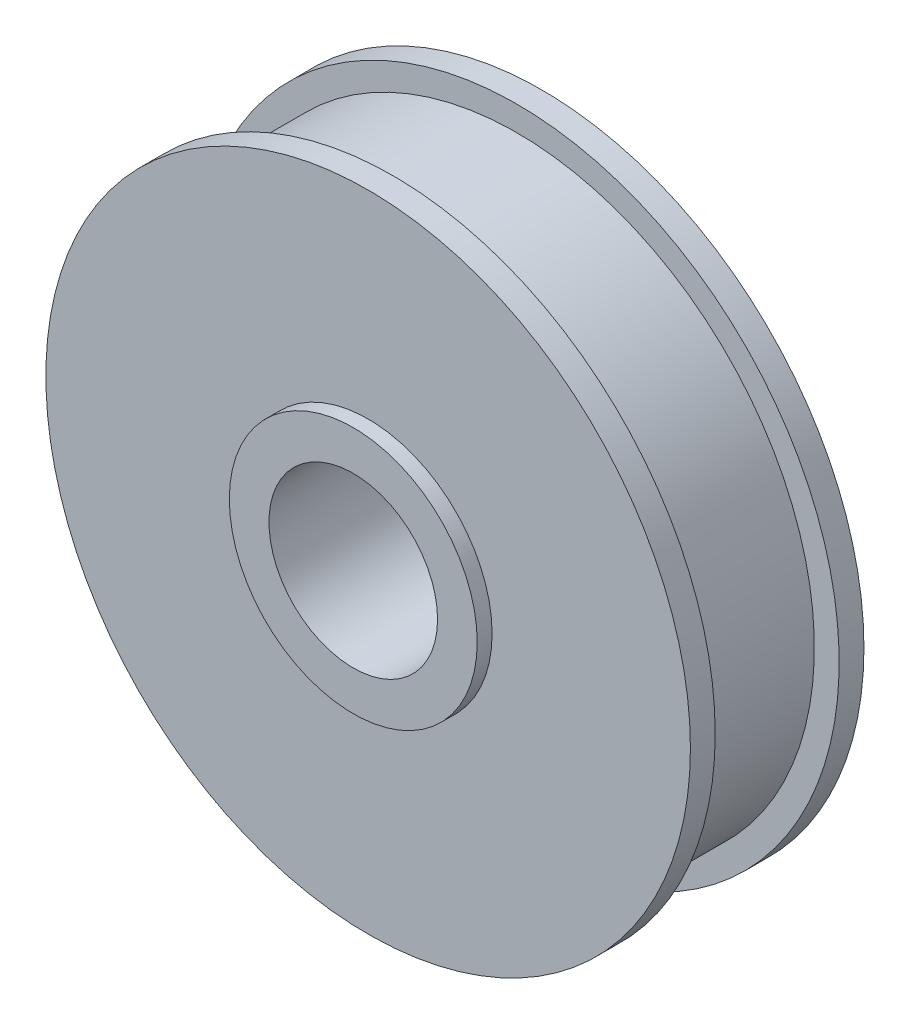
ISO-10303-21;
HEADER;
FILE_DESCRIPTION(('STEP AP214'),'2;1');
FILE_NAME('part.step','',(''),(''),'','','');
FILE_SCHEMA(('AUTOMOTIVE_DESIGN { 1 0 10303 214 1 1 1 1 }'));
ENDSEC;
DATA;
#1=APPLICATION_CONTEXT('core data for automotive mechanical design processes');
#2=APPLICATION_PROTOCOL_DEFINITION('international standard','automotive_design',2000,#1);
#3=PRODUCT_CONTEXT('',#1,'mechanical');
#4=PRODUCT('Part','Part','',(#3));
#5=PRODUCT_RELATED_PRODUCT_CATEGORY('part','',(#4));
#6=PRODUCT_DEFINITION_FORMATION('','',#4);
#7=PRODUCT_DEFINITION_CONTEXT('part definition',#1,'design');
#8=PRODUCT_DEFINITION('design','',#6,#7);
#9=PRODUCT_DEFINITION_SHAPE('','',#8);
#10=(LENGTH_UNIT() NAMED_UNIT(*) SI_UNIT(.MILLI.,.METRE.));
#11=(NAMED_UNIT(*) PLANE_ANGLE_UNIT() SI_UNIT($,.RADIAN.));
#12=(NAMED_UNIT(*) SI_UNIT($,.STERADIAN.) SOLID_ANGLE_UNIT());
#13=UNCERTAINTY_MEASURE_WITH_UNIT(LENGTH_MEASURE(1.E-05),#10,'distance_accuracy_value','');
#14=(GEOMETRIC_REPRESENTATION_CONTEXT(3) GLOBAL_UNCERTAINTY_ASSIGNED_CONTEXT((#13)) GLOBAL_UNIT_ASSIGNED_CONTEXT((#10,
#11,#12)) REPRESENTATION_CONTEXT('',''));
#15=CARTESIAN_POINT('',(0.,0.,0.));
#16=DIRECTION('',(0.,0.,1.));
#17=DIRECTION('',(1.,0.,0.));
#18=AXIS2_PLACEMENT_3D('',#15,#16,#17);
#19=CARTESIAN_POINT('',(0.,0.,3.5));
#20=DIRECTION('',(0.,0.,1.));
#21=DIRECTION('',(1.,0.,0.));
#22=AXIS2_PLACEMENT_3D('',#19,#20,#21);
#23=PLANE('',#22);
#24=CARTESIAN_POINT('',(0.,0.,3.5));
#25=DIRECTION('',(0.,0.,1.));
#26=DIRECTION('',(1.,0.,0.));
#27=AXIS2_PLACEMENT_3D('',#24,#25,#26);
#28=CIRCLE('',#27,6.5);
#29=CARTESIAN_POINT('',(6.5,0.,3.5));
#30=VERTEX_POINT('',#29);
#31=EDGE_CURVE('E11',#30,#30,#28,.T.);
#32=ORIENTED_EDGE('',*,*,#31,.T.);
#33=EDGE_LOOP('',(#32));
#34=FACE_BOUND('',#33,.T.);
#35=CARTESIAN_POINT('',(0.,0.,3.5));
#36=DIRECTION('',(0.,0.,1.));
#37=DIRECTION('',(1.,0.,0.));
#38=AXIS2_PLACEMENT_3D('',#35,#36,#37);
#39=CIRCLE('',#38,2.5);
#40=CARTESIAN_POINT('',(2.5,0.,3.5));
#41=VERTEX_POINT('',#40);
#42=EDGE_CURVE('E47',#41,#41,#39,.T.);
#43=ORIENTED_EDGE('',*,*,#42,.F.);
#44=EDGE_LOOP('',(#43));
#45=FACE_BOUND('',#44,.T.);
#46=ADVANCED_FACE('F34',(#34,#45),#23,.T.);
#47=CARTESIAN_POINT('',(0.,0.,3.5));
#48=DIRECTION('',(0.,0.,-1.));
#49=DIRECTION('',(-1.,0.,0.));
#50=AXIS2_PLACEMENT_3D('',#47,#48,#49);
#51=CYLINDRICAL_SURFACE('',#50,6.5);
#52=CARTESIAN_POINT('',(0.,0.,3.));
#53=DIRECTION('',(0.,0.,1.));
#54=DIRECTION('',(1.,0.,0.));
#55=AXIS2_PLACEMENT_3D('',#52,#53,#54);
#56=CIRCLE('',#55,6.5);
#57=CARTESIAN_POINT('',(6.5,0.,3.));
#58=VERTEX_POINT('',#57);
#59=EDGE_CURVE('E56',#58,#58,#56,.F.);
#60=ORIENTED_EDGE('',*,*,#59,.F.);
#61=EDGE_LOOP('',(#60));
#62=FACE_BOUND('',#61,.T.);
#63=ORIENTED_EDGE('',*,*,#31,.F.);
#64=EDGE_LOOP('',(#63));
#65=FACE_BOUND('',#64,.T.);
#66=ADVANCED_FACE('F36',(#62,#65),#51,.T.);
#67=CARTESIAN_POINT('',(0.,0.,3.8));
#68=DIRECTION('',(0.,0.,-1.));
#69=DIRECTION('',(-1.,0.,0.));
#70=AXIS2_PLACEMENT_3D('',#67,#68,#69);
#71=CYLINDRICAL_SURFACE('',#70,2.5);
#72=CARTESIAN_POINT('',(0.,0.,3.8));
#73=DIRECTION('',(0.,0.,1.));
#74=DIRECTION('',(1.,0.,0.));
#75=AXIS2_PLACEMENT_3D('',#72,#73,#74);
#76=CIRCLE('',#75,2.5);
#77=CARTESIAN_POINT('',(2.5,0.,3.8));
#78=VERTEX_POINT('',#77);
#79=EDGE_CURVE('E45',#78,#78,#76,.T.);
#80=ORIENTED_EDGE('',*,*,#79,.F.);
#81=EDGE_LOOP('',(#80));
#82=FACE_BOUND('',#81,.T.);
#83=ORIENTED_EDGE('',*,*,#42,.T.);
#84=EDGE_LOOP('',(#83));
#85=FACE_BOUND('',#84,.T.);
#86=ADVANCED_FACE('F85',(#82,#85),#71,.T.);
#87=CARTESIAN_POINT('',(0.,0.,3.8));
#88=DIRECTION('',(0.,0.,1.));
#89=DIRECTION('',(1.,0.,0.));
#90=AXIS2_PLACEMENT_3D('',#87,#88,#89);
#91=PLANE('',#90);
#92=CARTESIAN_POINT('',(0.,0.,3.8));
#93=DIRECTION('',(0.,0.,1.));
#94=DIRECTION('',(1.,0.,0.));
#95=AXIS2_PLACEMENT_3D('',#92,#93,#94);
#96=CIRCLE('',#95,1.7);
#97=CARTESIAN_POINT('',(1.7,0.,3.8));
#98=VERTEX_POINT('',#97);
#99=EDGE_CURVE('E65',#98,#98,#96,.T.);
#100=ORIENTED_EDGE('',*,*,#99,.F.);
#101=EDGE_LOOP('',(#100));
#102=FACE_BOUND('',#101,.T.);
#103=ORIENTED_EDGE('',*,*,#79,.T.);
#104=EDGE_LOOP('',(#103));
#105=FACE_BOUND('',#104,.T.);
#106=ADVANCED_FACE('F81',(#102,#105),#91,.T.);
#107=CARTESIAN_POINT('',(0.,0.,21.8847763108502));
#108=DIRECTION('',(0.,0.,-1.));
#109=DIRECTION('',(-1.,0.,0.));
#110=AXIS2_PLACEMENT_3D('',#107,#108,#109);
#111=CYLINDRICAL_SURFACE('',#110,6.);
#112=CARTESIAN_POINT('',(0.,0.,0.5));
#113=DIRECTION('',(0.,0.,-1.));
#114=DIRECTION('',(-1.,0.,0.));
#115=AXIS2_PLACEMENT_3D('',#112,#113,#114);
#116=CIRCLE('',#115,6.);
#117=CARTESIAN_POINT('',(-6.,0.,0.5));
#118=VERTEX_POINT('',#117);
#119=EDGE_CURVE('E59',#118,#118,#116,.T.);
#120=ORIENTED_EDGE('',*,*,#119,.F.);
#121=EDGE_LOOP('',(#120));
#122=FACE_BOUND('',#121,.T.);
#123=CARTESIAN_POINT('',(0.,0.,3.));
#124=DIRECTION('',(0.,0.,1.));
#125=DIRECTION('',(1.,0.,0.));
#126=AXIS2_PLACEMENT_3D('',#123,#124,#125);
#127=CIRCLE('',#126,6.);
#128=CARTESIAN_POINT('',(6.,0.,3.));
#129=VERTEX_POINT('',#128);
#130=EDGE_CURVE('E50',#129,#129,#127,.F.);
#131=ORIENTED_EDGE('',*,*,#130,.T.);
#132=EDGE_LOOP('',(#131));
#133=FACE_BOUND('',#132,.T.);
#134=ADVANCED_FACE('F84',(#122,#133),#111,.T.);
#135=CARTESIAN_POINT('',(0.,0.,0.5));
#136=DIRECTION('',(0.,0.,-1.));
#137=DIRECTION('',(-1.,0.,0.));
#138=AXIS2_PLACEMENT_3D('',#135,#136,#137);
#139=PLANE('',#138);
#140=ORIENTED_EDGE('',*,*,#119,.T.);
#141=EDGE_LOOP('',(#140));
#142=FACE_BOUND('',#141,.T.);
#143=CARTESIAN_POINT('',(0.,0.,0.5));
#144=DIRECTION('',(0.,0.,-1.));
#145=DIRECTION('',(-1.,0.,0.));
#146=AXIS2_PLACEMENT_3D('',#143,#144,#145);
#147=CIRCLE('',#146,6.5);
#148=CARTESIAN_POINT('',(-6.5,0.,0.5));
#149=VERTEX_POINT('',#148);
#150=EDGE_CURVE('E55',#149,#149,#147,.T.);
#151=ORIENTED_EDGE('',*,*,#150,.F.);
#152=EDGE_LOOP('',(#151));
#153=FACE_BOUND('',#152,.T.);
#154=ADVANCED_FACE('F107',(#142,#153),#139,.F.);
#155=CARTESIAN_POINT('',(0.,0.,3.));
#156=DIRECTION('',(0.,0.,1.));
#157=DIRECTION('',(1.,0.,0.));
#158=AXIS2_PLACEMENT_3D('',#155,#156,#157);
#159=PLANE('',#158);
#160=ORIENTED_EDGE('',*,*,#59,.T.);
#161=EDGE_LOOP('',(#160));
#162=FACE_BOUND('',#161,.T.);
#163=ORIENTED_EDGE('',*,*,#130,.F.);
#164=EDGE_LOOP('',(#163));
#165=FACE_BOUND('',#164,.T.);
#166=ADVANCED_FACE('F101',(#162,#165),#159,.F.);
#167=CARTESIAN_POINT('',(0.,0.,0.));
#168=DIRECTION('',(0.,0.,1.));
#169=DIRECTION('',(1.,0.,0.));
#170=AXIS2_PLACEMENT_3D('',#167,#168,#169);
#171=PLANE('',#170);
#172=CARTESIAN_POINT('',(0.,0.,0.));
#173=DIRECTION('',(0.,0.,1.));
#174=DIRECTION('',(1.,0.,0.));
#175=AXIS2_PLACEMENT_3D('',#172,#173,#174);
#176=CIRCLE('',#175,1.7);
#177=CARTESIAN_POINT('',(1.7,0.,0.));
#178=VERTEX_POINT('',#177);
#179=EDGE_CURVE('E60',#178,#178,#176,.T.);
#180=ORIENTED_EDGE('',*,*,#179,.T.);
#181=EDGE_LOOP('',(#180));
#182=FACE_BOUND('',#181,.T.);
#183=CARTESIAN_POINT('',(0.,0.,0.));
#184=DIRECTION('',(0.,0.,1.));
#185=DIRECTION('',(1.,0.,0.));
#186=AXIS2_PLACEMENT_3D('',#183,#184,#185);
#187=CIRCLE('',#186,6.5);
#188=CARTESIAN_POINT('',(6.5,0.,0.));
#189=VERTEX_POINT('',#188);
#190=EDGE_CURVE('E38',#189,#189,#187,.T.);
#191=ORIENTED_EDGE('',*,*,#190,.F.);
#192=EDGE_LOOP('',(#191));
#193=FACE_BOUND('',#192,.T.);
#194=ADVANCED_FACE('F71',(#182,#193),#171,.F.);
#195=ORIENTED_EDGE('',*,*,#150,.T.);
#196=EDGE_LOOP('',(#195));
#197=FACE_BOUND('',#196,.T.);
#198=ORIENTED_EDGE('',*,*,#190,.T.);
#199=EDGE_LOOP('',(#198));
#200=FACE_BOUND('',#199,.T.);
#201=ADVANCED_FACE('F77',(#197,#200),#51,.T.);
#202=CARTESIAN_POINT('',(0.,0.,0.));
#203=DIRECTION('',(0.,0.,1.));
#204=DIRECTION('',(1.,0.,0.));
#205=AXIS2_PLACEMENT_3D('',#202,#203,#204);
#206=CYLINDRICAL_SURFACE('',#205,1.7);
#207=ORIENTED_EDGE('',*,*,#179,.F.);
#208=EDGE_LOOP('',(#207));
#209=FACE_BOUND('',#208,.T.);
#210=ORIENTED_EDGE('',*,*,#99,.T.);
#211=EDGE_LOOP('',(#210));
#212=FACE_BOUND('',#211,.T.);
#213=ADVANCED_FACE('F74',(#209,#212),#206,.F.);
#214=CLOSED_SHELL('',(#46,#66,#86,#106,#134,#154,#166,#194,#201,#213));
#215=MANIFOLD_SOLID_BREP('B2',#214);
#216=ADVANCED_BREP_SHAPE_REPRESENTATION('',(#18,#215),#14);
#217=SHAPE_DEFINITION_REPRESENTATION(#9,#216);
ENDSEC;
END-ISO-10303-21;
